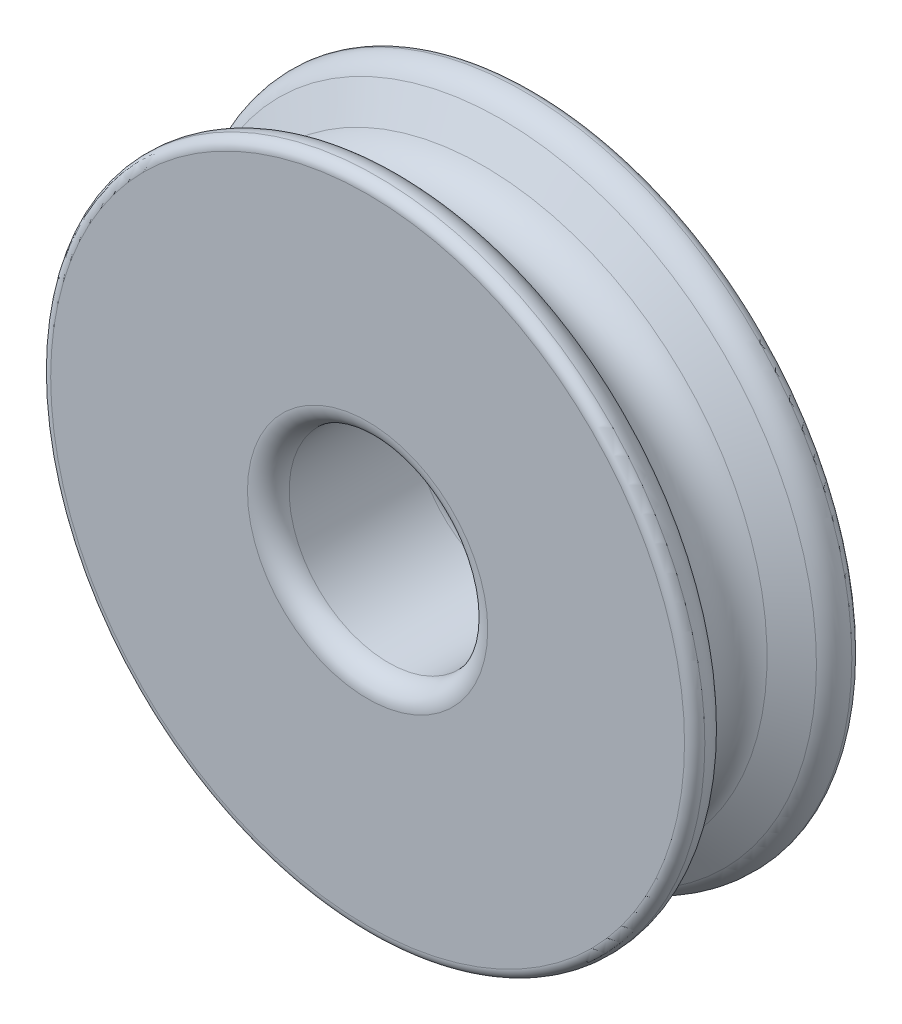
ISO-10303-21;
HEADER;
FILE_DESCRIPTION(('STEP AP214'),'2;1');
FILE_NAME('part.step','',(''),(''),'','','');
FILE_SCHEMA(('AUTOMOTIVE_DESIGN { 1 0 10303 214 1 1 1 1 }'));
ENDSEC;
DATA;
#1=APPLICATION_CONTEXT('core data for automotive mechanical design processes');
#2=APPLICATION_PROTOCOL_DEFINITION('international standard','automotive_design',2000,#1);
#3=PRODUCT_CONTEXT('',#1,'mechanical');
#4=PRODUCT('Part','Part','',(#3));
#5=PRODUCT_RELATED_PRODUCT_CATEGORY('part','',(#4));
#6=PRODUCT_DEFINITION_FORMATION('','',#4);
#7=PRODUCT_DEFINITION_CONTEXT('part definition',#1,'design');
#8=PRODUCT_DEFINITION('design','',#6,#7);
#9=PRODUCT_DEFINITION_SHAPE('','',#8);
#10=(LENGTH_UNIT() NAMED_UNIT(*) SI_UNIT(.MILLI.,.METRE.));
#11=(NAMED_UNIT(*) PLANE_ANGLE_UNIT() SI_UNIT($,.RADIAN.));
#12=(NAMED_UNIT(*) SI_UNIT($,.STERADIAN.) SOLID_ANGLE_UNIT());
#13=UNCERTAINTY_MEASURE_WITH_UNIT(LENGTH_MEASURE(1.E-05),#10,'distance_accuracy_value','');
#14=(GEOMETRIC_REPRESENTATION_CONTEXT(3) GLOBAL_UNCERTAINTY_ASSIGNED_CONTEXT((#13)) GLOBAL_UNIT_ASSIGNED_CONTEXT((#10,
#11,#12)) REPRESENTATION_CONTEXT('',''));
#15=CARTESIAN_POINT('',(0.,0.,0.));
#16=DIRECTION('',(0.,0.,1.));
#17=DIRECTION('',(1.,0.,0.));
#18=AXIS2_PLACEMENT_3D('',#15,#16,#17);
#19=CARTESIAN_POINT('',(0.,0.,-3.5));
#20=DIRECTION('',(0.,0.,-1.));
#21=DIRECTION('',(-1.,0.,0.));
#22=AXIS2_PLACEMENT_3D('',#19,#20,#21);
#23=TOROIDAL_SURFACE('',#22,15.2006264756117,0.499999999999999);
#24=CARTESIAN_POINT('',(0.,0.,-3.52502165342211));
#25=DIRECTION('',(0.,0.,-1.));
#26=DIRECTION('',(-1.,0.,0.));
#27=AXIS2_PLACEMENT_3D('',#24,#25,#26);
#28=CIRCLE('',#27,15.7);
#29=CARTESIAN_POINT('',(-15.7,0.,-3.52502165342211));
#30=VERTEX_POINT('',#29);
#31=EDGE_CURVE('E51',#30,#30,#28,.T.);
#32=ORIENTED_EDGE('',*,*,#31,.T.);
#33=EDGE_LOOP('',(#32));
#34=FACE_BOUND('',#33,.T.);
#35=CARTESIAN_POINT('',(0.,0.,-4.));
#36=DIRECTION('',(0.,0.,-1.));
#37=DIRECTION('',(-1.,0.,0.));
#38=AXIS2_PLACEMENT_3D('',#35,#36,#37);
#39=CIRCLE('',#38,15.2006264756117);
#40=CARTESIAN_POINT('',(-15.2006264756117,0.,-4.));
#41=VERTEX_POINT('',#40);
#42=EDGE_CURVE('E72',#41,#41,#39,.T.);
#43=ORIENTED_EDGE('',*,*,#42,.F.);
#44=EDGE_LOOP('',(#43));
#45=FACE_BOUND('',#44,.T.);
#46=ADVANCED_FACE('F31',(#34,#45),#23,.T.);
#47=CARTESIAN_POINT('',(0.,0.,-3.46496968520905));
#48=DIRECTION('',(0.,0.,-1.));
#49=DIRECTION('',(-1.,0.,0.));
#50=AXIS2_PLACEMENT_3D('',#47,#48,#49);
#51=TOROIDAL_SURFACE('',#50,14.501503541468,1.2);
#52=CARTESIAN_POINT('',(0.,0.,-2.42573920066772));
#53=DIRECTION('',(0.,0.,-1.));
#54=DIRECTION('',(-1.,0.,0.));
#55=AXIS2_PLACEMENT_3D('',#52,#53,#54);
#56=CIRCLE('',#55,15.101503541468);
#57=CARTESIAN_POINT('',(-15.101503541468,0.,-2.42573920066772));
#58=VERTEX_POINT('',#57);
#59=EDGE_CURVE('E54',#58,#58,#56,.T.);
#60=ORIENTED_EDGE('',*,*,#59,.T.);
#61=EDGE_LOOP('',(#60));
#62=FACE_BOUND('',#61,.T.);
#63=ORIENTED_EDGE('',*,*,#31,.F.);
#64=EDGE_LOOP('',(#63));
#65=FACE_BOUND('',#64,.T.);
#66=ADVANCED_FACE('F79',(#62,#65),#51,.T.);
#67=CARTESIAN_POINT('',(0.,0.,-2.42573920066772));
#68=DIRECTION('',(0.,0.,-1.));
#69=DIRECTION('',(-1.,0.,0.));
#70=AXIS2_PLACEMENT_3D('',#67,#68,#69);
#71=CONICAL_SURFACE('',#70,15.101503541468,1.0471975511966);
#72=CARTESIAN_POINT('',(0.,0.,-1.55884572681199));
#73=DIRECTION('',(0.,0.,-1.));
#74=DIRECTION('',(-1.,0.,0.));
#75=AXIS2_PLACEMENT_3D('',#72,#73,#74);
#76=CIRCLE('',#75,13.6);
#77=CARTESIAN_POINT('',(-13.6,0.,-1.55884572681199));
#78=VERTEX_POINT('',#77);
#79=EDGE_CURVE('E57',#78,#78,#76,.T.);
#80=ORIENTED_EDGE('',*,*,#79,.T.);
#81=EDGE_LOOP('',(#80));
#82=FACE_BOUND('',#81,.T.);
#83=ORIENTED_EDGE('',*,*,#59,.F.);
#84=EDGE_LOOP('',(#83));
#85=FACE_BOUND('',#84,.T.);
#86=ADVANCED_FACE('F85',(#82,#85),#71,.T.);
#87=CARTESIAN_POINT('',(0.,0.,0.));
#88=DIRECTION('',(0.,0.,-1.));
#89=DIRECTION('',(-1.,0.,0.));
#90=AXIS2_PLACEMENT_3D('',#87,#88,#89);
#91=TOROIDAL_SURFACE('',#90,14.5,1.8);
#92=CARTESIAN_POINT('',(0.,0.,1.55884572681199));
#93=DIRECTION('',(0.,0.,-1.));
#94=DIRECTION('',(-1.,0.,0.));
#95=AXIS2_PLACEMENT_3D('',#92,#93,#94);
#96=CIRCLE('',#95,13.6);
#97=CARTESIAN_POINT('',(-13.6,0.,1.55884572681199));
#98=VERTEX_POINT('',#97);
#99=EDGE_CURVE('E60',#98,#98,#96,.T.);
#100=ORIENTED_EDGE('',*,*,#99,.T.);
#101=EDGE_LOOP('',(#100));
#102=FACE_BOUND('',#101,.T.);
#103=ORIENTED_EDGE('',*,*,#79,.F.);
#104=EDGE_LOOP('',(#103));
#105=FACE_BOUND('',#104,.T.);
#106=ADVANCED_FACE('F121',(#102,#105),#91,.F.);
#107=CARTESIAN_POINT('',(0.,0.,1.55884572681199));
#108=DIRECTION('',(0.,0.,1.));
#109=DIRECTION('',(1.,0.,0.));
#110=AXIS2_PLACEMENT_3D('',#107,#108,#109);
#111=CONICAL_SURFACE('',#110,13.6,1.0471975511966);
#112=CARTESIAN_POINT('',(0.,0.,2.42573920066772));
#113=DIRECTION('',(0.,0.,-1.));
#114=DIRECTION('',(-1.,0.,0.));
#115=AXIS2_PLACEMENT_3D('',#112,#113,#114);
#116=CIRCLE('',#115,15.101503541468);
#117=CARTESIAN_POINT('',(-15.101503541468,0.,2.42573920066772));
#118=VERTEX_POINT('',#117);
#119=EDGE_CURVE('E63',#118,#118,#116,.T.);
#120=ORIENTED_EDGE('',*,*,#119,.T.);
#121=EDGE_LOOP('',(#120));
#122=FACE_BOUND('',#121,.T.);
#123=ORIENTED_EDGE('',*,*,#99,.F.);
#124=EDGE_LOOP('',(#123));
#125=FACE_BOUND('',#124,.T.);
#126=ADVANCED_FACE('F117',(#122,#125),#111,.T.);
#127=CARTESIAN_POINT('',(0.,0.,3.46496968520905));
#128=DIRECTION('',(0.,0.,-1.));
#129=DIRECTION('',(-1.,0.,0.));
#130=AXIS2_PLACEMENT_3D('',#127,#128,#129);
#131=TOROIDAL_SURFACE('',#130,14.501503541468,1.2);
#132=CARTESIAN_POINT('',(0.,0.,3.52502165342211));
#133=DIRECTION('',(0.,0.,-1.));
#134=DIRECTION('',(-1.,0.,0.));
#135=AXIS2_PLACEMENT_3D('',#132,#133,#134);
#136=CIRCLE('',#135,15.7);
#137=CARTESIAN_POINT('',(-15.7,0.,3.52502165342211));
#138=VERTEX_POINT('',#137);
#139=EDGE_CURVE('E66',#138,#138,#136,.T.);
#140=ORIENTED_EDGE('',*,*,#139,.T.);
#141=EDGE_LOOP('',(#140));
#142=FACE_BOUND('',#141,.T.);
#143=ORIENTED_EDGE('',*,*,#119,.F.);
#144=EDGE_LOOP('',(#143));
#145=FACE_BOUND('',#144,.T.);
#146=ADVANCED_FACE('F113',(#142,#145),#131,.T.);
#147=CARTESIAN_POINT('',(0.,0.,3.5));
#148=DIRECTION('',(0.,0.,-1.));
#149=DIRECTION('',(-1.,0.,0.));
#150=AXIS2_PLACEMENT_3D('',#147,#148,#149);
#151=TOROIDAL_SURFACE('',#150,15.2006264756117,0.499999999999999);
#152=CARTESIAN_POINT('',(0.,0.,4.));
#153=DIRECTION('',(0.,0.,-1.));
#154=DIRECTION('',(-1.,0.,0.));
#155=AXIS2_PLACEMENT_3D('',#152,#153,#154);
#156=CIRCLE('',#155,15.2006264756117);
#157=CARTESIAN_POINT('',(-15.2006264756117,0.,4.));
#158=VERTEX_POINT('',#157);
#159=EDGE_CURVE('E69',#158,#158,#156,.T.);
#160=ORIENTED_EDGE('',*,*,#159,.T.);
#161=EDGE_LOOP('',(#160));
#162=FACE_BOUND('',#161,.T.);
#163=ORIENTED_EDGE('',*,*,#139,.F.);
#164=EDGE_LOOP('',(#163));
#165=FACE_BOUND('',#164,.T.);
#166=ADVANCED_FACE('F108',(#162,#165),#151,.T.);
#167=CARTESIAN_POINT('',(0.,0.,4.));
#168=DIRECTION('',(0.,0.,1.));
#169=DIRECTION('',(1.,0.,0.));
#170=AXIS2_PLACEMENT_3D('',#167,#168,#169);
#171=PLANE('',#170);
#172=CARTESIAN_POINT('',(0.,0.,4.));
#173=DIRECTION('',(0.,0.,1.));
#174=DIRECTION('',(1.,0.,0.));
#175=AXIS2_PLACEMENT_3D('',#172,#173,#174);
#176=CIRCLE('',#175,5.7625);
#177=CARTESIAN_POINT('',(5.7625,0.,4.));
#178=VERTEX_POINT('',#177);
#179=EDGE_CURVE('E10',#178,#178,#176,.F.);
#180=ORIENTED_EDGE('',*,*,#179,.T.);
#181=EDGE_LOOP('',(#180));
#182=FACE_BOUND('',#181,.T.);
#183=ORIENTED_EDGE('',*,*,#159,.F.);
#184=EDGE_LOOP('',(#183));
#185=FACE_BOUND('',#184,.T.);
#186=ADVANCED_FACE('F103',(#182,#185),#171,.T.);
#187=CARTESIAN_POINT('',(0.,0.,-4.));
#188=DIRECTION('',(0.,0.,-1.));
#189=DIRECTION('',(-1.,0.,0.));
#190=AXIS2_PLACEMENT_3D('',#187,#188,#189);
#191=PLANE('',#190);
#192=CARTESIAN_POINT('',(0.,0.,-4.));
#193=DIRECTION('',(0.,0.,-1.));
#194=DIRECTION('',(-1.,0.,0.));
#195=AXIS2_PLACEMENT_3D('',#192,#193,#194);
#196=CIRCLE('',#195,5.7625);
#197=CARTESIAN_POINT('',(-5.7625,0.,-4.));
#198=VERTEX_POINT('',#197);
#199=EDGE_CURVE('E46',#198,#198,#196,.F.);
#200=ORIENTED_EDGE('',*,*,#199,.T.);
#201=EDGE_LOOP('',(#200));
#202=FACE_BOUND('',#201,.T.);
#203=ORIENTED_EDGE('',*,*,#42,.T.);
#204=EDGE_LOOP('',(#203));
#205=FACE_BOUND('',#204,.T.);
#206=ADVANCED_FACE('F76',(#202,#205),#191,.T.);
#207=CARTESIAN_POINT('',(0.,0.,-4.));
#208=DIRECTION('',(0.,0.,1.));
#209=DIRECTION('',(1.,0.,0.));
#210=AXIS2_PLACEMENT_3D('',#207,#208,#209);
#211=CYLINDRICAL_SURFACE('',#210,4.7625);
#212=CARTESIAN_POINT('',(0.,0.,-3.));
#213=DIRECTION('',(0.,0.,-1.));
#214=DIRECTION('',(-1.,0.,0.));
#215=AXIS2_PLACEMENT_3D('',#212,#213,#214);
#216=CIRCLE('',#215,4.7625);
#217=CARTESIAN_POINT('',(-4.7625,0.,-3.));
#218=VERTEX_POINT('',#217);
#219=EDGE_CURVE('E38',#218,#218,#216,.T.);
#220=ORIENTED_EDGE('',*,*,#219,.T.);
#221=EDGE_LOOP('',(#220));
#222=FACE_BOUND('',#221,.T.);
#223=CARTESIAN_POINT('',(0.,0.,3.));
#224=DIRECTION('',(0.,0.,1.));
#225=DIRECTION('',(1.,0.,0.));
#226=AXIS2_PLACEMENT_3D('',#223,#224,#225);
#227=CIRCLE('',#226,4.7625);
#228=CARTESIAN_POINT('',(4.7625,0.,3.));
#229=VERTEX_POINT('',#228);
#230=EDGE_CURVE('E42',#229,#229,#227,.T.);
#231=ORIENTED_EDGE('',*,*,#230,.T.);
#232=EDGE_LOOP('',(#231));
#233=FACE_BOUND('',#232,.T.);
#234=ADVANCED_FACE('F91',(#222,#233),#211,.F.);
#235=CARTESIAN_POINT('',(0.,0.,-3.));
#236=DIRECTION('',(0.,0.,-1.));
#237=DIRECTION('',(-1.,0.,0.));
#238=AXIS2_PLACEMENT_3D('',#235,#236,#237);
#239=TOROIDAL_SURFACE('',#238,5.7625,1.);
#240=ORIENTED_EDGE('',*,*,#219,.F.);
#241=EDGE_LOOP('',(#240));
#242=FACE_BOUND('',#241,.T.);
#243=ORIENTED_EDGE('',*,*,#199,.F.);
#244=EDGE_LOOP('',(#243));
#245=FACE_BOUND('',#244,.T.);
#246=ADVANCED_FACE('F89',(#242,#245),#239,.T.);
#247=CARTESIAN_POINT('',(0.,0.,3.));
#248=DIRECTION('',(0.,0.,1.));
#249=DIRECTION('',(1.,0.,0.));
#250=AXIS2_PLACEMENT_3D('',#247,#248,#249);
#251=TOROIDAL_SURFACE('',#250,5.7625,1.);
#252=ORIENTED_EDGE('',*,*,#179,.F.);
#253=EDGE_LOOP('',(#252));
#254=FACE_BOUND('',#253,.T.);
#255=ORIENTED_EDGE('',*,*,#230,.F.);
#256=EDGE_LOOP('',(#255));
#257=FACE_BOUND('',#256,.T.);
#258=ADVANCED_FACE('F33',(#254,#257),#251,.T.);
#259=CLOSED_SHELL('',(#46,#66,#86,#106,#126,#146,#166,#186,#206,#234,#246,#258));
#260=MANIFOLD_SOLID_BREP('B2',#259);
#261=ADVANCED_BREP_SHAPE_REPRESENTATION('',(#18,#260),#14);
#262=SHAPE_DEFINITION_REPRESENTATION(#9,#261);
ENDSEC;
END-ISO-10303-21;
